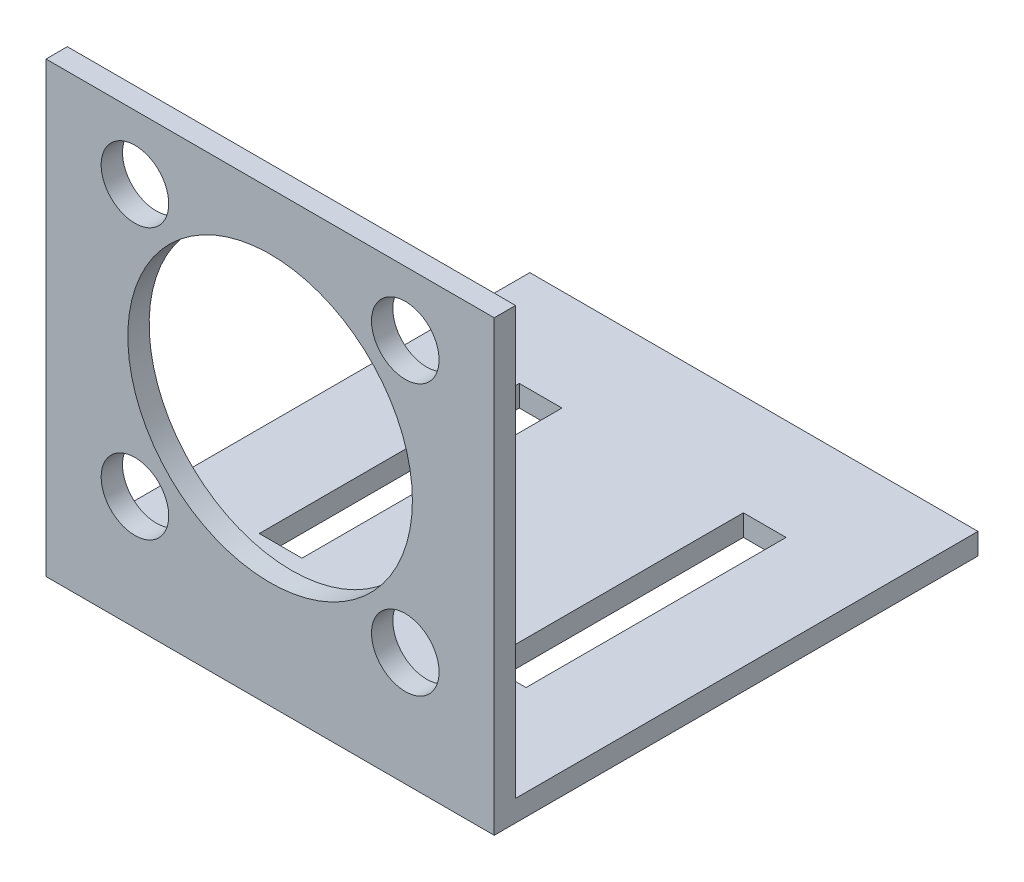
ISO-10303-21;
HEADER;
FILE_DESCRIPTION(('STEP AP214'),'2;1');
FILE_NAME('part.step','',(''),(''),'','','');
FILE_SCHEMA(('AUTOMOTIVE_DESIGN { 1 0 10303 214 1 1 1 1 }'));
ENDSEC;
DATA;
#1=APPLICATION_CONTEXT('core data for automotive mechanical design processes');
#2=APPLICATION_PROTOCOL_DEFINITION('international standard','automotive_design',2000,#1);
#3=PRODUCT_CONTEXT('',#1,'mechanical');
#4=PRODUCT('Part','Part','',(#3));
#5=PRODUCT_RELATED_PRODUCT_CATEGORY('part','',(#4));
#6=PRODUCT_DEFINITION_FORMATION('','',#4);
#7=PRODUCT_DEFINITION_CONTEXT('part definition',#1,'design');
#8=PRODUCT_DEFINITION('design','',#6,#7);
#9=PRODUCT_DEFINITION_SHAPE('','',#8);
#10=(LENGTH_UNIT() NAMED_UNIT(*) SI_UNIT(.MILLI.,.METRE.));
#11=(NAMED_UNIT(*) PLANE_ANGLE_UNIT() SI_UNIT($,.RADIAN.));
#12=(NAMED_UNIT(*) SI_UNIT($,.STERADIAN.) SOLID_ANGLE_UNIT());
#13=UNCERTAINTY_MEASURE_WITH_UNIT(LENGTH_MEASURE(1.E-05),#10,'distance_accuracy_value','');
#14=(GEOMETRIC_REPRESENTATION_CONTEXT(3) GLOBAL_UNCERTAINTY_ASSIGNED_CONTEXT((#13)) GLOBAL_UNIT_ASSIGNED_CONTEXT((#10,
#11,#12)) REPRESENTATION_CONTEXT('',''));
#15=CARTESIAN_POINT('',(0.,0.,0.));
#16=DIRECTION('',(0.,0.,1.));
#17=DIRECTION('',(1.,0.,0.));
#18=AXIS2_PLACEMENT_3D('',#15,#16,#17);
#19=CARTESIAN_POINT('',(63.,29.4238410596027,34.8026733297217));
#20=DIRECTION('',(0.,-1.,0.));
#21=DIRECTION('',(0.,0.,-1.));
#22=AXIS2_PLACEMENT_3D('',#19,#20,#21);
#23=PLANE('',#22);
#24=DIRECTION('',(0.,0.,1.));
#25=VECTOR('',#24,1.);
#26=CARTESIAN_POINT('',(0.,29.4238410596027,34.8026733297217));
#27=LINE('',#26,#25);
#28=CARTESIAN_POINT('',(0.,29.4238410596027,31.8026733297217));
#29=VERTEX_POINT('',#28);
#30=CARTESIAN_POINT('',(0.,29.4238410596027,34.8026733297217));
#31=VERTEX_POINT('',#30);
#32=EDGE_CURVE('E235',#29,#31,#27,.T.);
#33=ORIENTED_EDGE('',*,*,#32,.T.);
#34=DIRECTION('',(-1.,0.,0.));
#35=VECTOR('',#34,1.);
#36=CARTESIAN_POINT('',(63.,29.4238410596027,34.8026733297217));
#37=LINE('',#36,#35);
#38=CARTESIAN_POINT('',(63.,29.4238410596027,34.8026733297217));
#39=VERTEX_POINT('',#38);
#40=EDGE_CURVE('E11',#39,#31,#37,.T.);
#41=ORIENTED_EDGE('',*,*,#40,.F.);
#42=DIRECTION('',(0.,0.,1.));
#43=VECTOR('',#42,1.);
#44=CARTESIAN_POINT('',(63.,29.4238410596027,34.8026733297217));
#45=LINE('',#44,#43);
#46=CARTESIAN_POINT('',(63.,29.4238410596027,31.8026733297217));
#47=VERTEX_POINT('',#46);
#48=EDGE_CURVE('E220',#47,#39,#45,.T.);
#49=ORIENTED_EDGE('',*,*,#48,.F.);
#50=DIRECTION('',(-1.,0.,0.));
#51=VECTOR('',#50,1.);
#52=CARTESIAN_POINT('',(63.,29.4238410596027,31.8026733297217));
#53=LINE('',#52,#51);
#54=EDGE_CURVE('E234',#47,#29,#53,.T.);
#55=ORIENTED_EDGE('',*,*,#54,.T.);
#56=EDGE_LOOP('',(#33,#41,#49,#55));
#57=FACE_BOUND('',#56,.T.);
#58=ADVANCED_FACE('F32',(#57),#23,.F.);
#59=CARTESIAN_POINT('',(63.,-33.5761589403973,34.8026733297217));
#60=DIRECTION('',(0.,0.,-1.));
#61=DIRECTION('',(0.,1.,0.));
#62=AXIS2_PLACEMENT_3D('',#59,#60,#61);
#63=PLANE('',#62);
#64=CARTESIAN_POINT('',(50.5,20.4238410596027,34.8026733297217));
#65=DIRECTION('',(0.,0.,1.));
#66=DIRECTION('',(-1.,0.,0.));
#67=AXIS2_PLACEMENT_3D('',#64,#65,#66);
#68=CIRCLE('',#67,4.74999999999999);
#69=CARTESIAN_POINT('',(45.75,20.4238410596027,34.8026733297217));
#70=VERTEX_POINT('',#69);
#71=EDGE_CURVE('E211',#70,#70,#68,.T.);
#72=ORIENTED_EDGE('',*,*,#71,.F.);
#73=EDGE_LOOP('',(#72));
#74=FACE_BOUND('',#73,.T.);
#75=CARTESIAN_POINT('',(12.5,-17.5761589403973,34.8026733297217));
#76=DIRECTION('',(0.,0.,1.));
#77=DIRECTION('',(-1.,0.,0.));
#78=AXIS2_PLACEMENT_3D('',#75,#76,#77);
#79=CIRCLE('',#78,4.75);
#80=CARTESIAN_POINT('',(7.74999999999999,-17.5761589403973,34.8026733297217));
#81=VERTEX_POINT('',#80);
#82=EDGE_CURVE('E210',#81,#81,#79,.T.);
#83=ORIENTED_EDGE('',*,*,#82,.F.);
#84=EDGE_LOOP('',(#83));
#85=FACE_BOUND('',#84,.T.);
#86=CARTESIAN_POINT('',(31.5,1.42384105960268,34.8026733297217));
#87=DIRECTION('',(0.,0.,1.));
#88=DIRECTION('',(1.,0.,0.));
#89=AXIS2_PLACEMENT_3D('',#86,#87,#88);
#90=CIRCLE('',#89,20.);
#91=CARTESIAN_POINT('',(51.5,1.42384105960268,34.8026733297217));
#92=VERTEX_POINT('',#91);
#93=EDGE_CURVE('E172',#92,#92,#90,.T.);
#94=ORIENTED_EDGE('',*,*,#93,.F.);
#95=EDGE_LOOP('',(#94));
#96=FACE_BOUND('',#95,.T.);
#97=CARTESIAN_POINT('',(12.5,20.4238410596027,34.8026733297217));
#98=DIRECTION('',(0.,0.,1.));
#99=DIRECTION('',(1.,0.,0.));
#100=AXIS2_PLACEMENT_3D('',#97,#98,#99);
#101=CIRCLE('',#100,4.74999999999999);
#102=CARTESIAN_POINT('',(17.25,20.4238410596027,34.8026733297217));
#103=VERTEX_POINT('',#102);
#104=EDGE_CURVE('E207',#103,#103,#101,.T.);
#105=ORIENTED_EDGE('',*,*,#104,.F.);
#106=EDGE_LOOP('',(#105));
#107=FACE_BOUND('',#106,.T.);
#108=CARTESIAN_POINT('',(50.5,-17.5761589403973,34.8026733297217));
#109=DIRECTION('',(0.,0.,1.));
#110=DIRECTION('',(1.,0.,0.));
#111=AXIS2_PLACEMENT_3D('',#108,#109,#110);
#112=CIRCLE('',#111,4.75);
#113=CARTESIAN_POINT('',(55.25,-17.5761589403973,34.8026733297217));
#114=VERTEX_POINT('',#113);
#115=EDGE_CURVE('E214',#114,#114,#112,.T.);
#116=ORIENTED_EDGE('',*,*,#115,.F.);
#117=EDGE_LOOP('',(#116));
#118=FACE_BOUND('',#117,.T.);
#119=DIRECTION('',(0.,-1.,0.));
#120=VECTOR('',#119,1.);
#121=CARTESIAN_POINT('',(0.,-33.5761589403973,34.8026733297217));
#122=LINE('',#121,#120);
#123=CARTESIAN_POINT('',(0.,-33.5761589403973,34.8026733297217));
#124=VERTEX_POINT('',#123);
#125=EDGE_CURVE('E238',#31,#124,#122,.T.);
#126=ORIENTED_EDGE('',*,*,#125,.T.);
#127=DIRECTION('',(-1.,0.,0.));
#128=VECTOR('',#127,1.);
#129=CARTESIAN_POINT('',(63.,-33.5761589403973,34.8026733297217));
#130=LINE('',#129,#128);
#131=CARTESIAN_POINT('',(63.,-33.5761589403973,34.8026733297217));
#132=VERTEX_POINT('',#131);
#133=EDGE_CURVE('E40',#132,#124,#130,.T.);
#134=ORIENTED_EDGE('',*,*,#133,.F.);
#135=DIRECTION('',(0.,-1.,0.));
#136=VECTOR('',#135,1.);
#137=CARTESIAN_POINT('',(63.,-33.5761589403973,34.8026733297217));
#138=LINE('',#137,#136);
#139=EDGE_CURVE('E223',#39,#132,#138,.T.);
#140=ORIENTED_EDGE('',*,*,#139,.F.);
#141=ORIENTED_EDGE('',*,*,#40,.T.);
#142=EDGE_LOOP('',(#126,#134,#140,#141));
#143=FACE_BOUND('',#142,.T.);
#144=ADVANCED_FACE('F294',(#74,#85,#96,#107,#118,#143),#63,.F.);
#145=CARTESIAN_POINT('',(63.,-33.5761589403973,-33.1973266702783));
#146=DIRECTION('',(0.,1.,0.));
#147=DIRECTION('',(0.,0.,1.));
#148=AXIS2_PLACEMENT_3D('',#145,#146,#147);
#149=PLANE('',#148);
#150=DIRECTION('',(-1.,0.,0.));
#151=VECTOR('',#150,1.);
#152=CARTESIAN_POINT('',(12.75,-33.5761589403973,-18.9726347985289));
#153=LINE('',#152,#151);
#154=CARTESIAN_POINT('',(18.75,-33.5761589403973,-18.9726347985289));
#155=VERTEX_POINT('',#154);
#156=CARTESIAN_POINT('',(12.75,-33.5761589403973,-18.9726347985289));
#157=VERTEX_POINT('',#156);
#158=EDGE_CURVE('E146',#155,#157,#153,.T.);
#159=ORIENTED_EDGE('',*,*,#158,.T.);
#160=DIRECTION('',(0.,0.,1.));
#161=VECTOR('',#160,1.);
#162=CARTESIAN_POINT('',(12.75,-33.5761589403973,-18.9726347985289));
#163=LINE('',#162,#161);
#164=CARTESIAN_POINT('',(12.75,-33.5761589403973,17.5779814579723));
#165=VERTEX_POINT('',#164);
#166=EDGE_CURVE('E138',#157,#165,#163,.T.);
#167=ORIENTED_EDGE('',*,*,#166,.T.);
#168=DIRECTION('',(1.,0.,0.));
#169=VECTOR('',#168,1.);
#170=CARTESIAN_POINT('',(12.75,-33.5761589403973,17.5779814579723));
#171=LINE('',#170,#169);
#172=CARTESIAN_POINT('',(18.75,-33.5761589403973,17.5779814579723));
#173=VERTEX_POINT('',#172);
#174=EDGE_CURVE('E149',#165,#173,#171,.T.);
#175=ORIENTED_EDGE('',*,*,#174,.T.);
#176=DIRECTION('',(0.,0.,-1.));
#177=VECTOR('',#176,1.);
#178=CARTESIAN_POINT('',(18.75,-33.5761589403973,-18.9726347985289));
#179=LINE('',#178,#177);
#180=EDGE_CURVE('E48',#173,#155,#179,.T.);
#181=ORIENTED_EDGE('',*,*,#180,.T.);
#182=EDGE_LOOP('',(#159,#167,#175,#181));
#183=FACE_BOUND('',#182,.T.);
#184=DIRECTION('',(1.,0.,0.));
#185=VECTOR('',#184,1.);
#186=CARTESIAN_POINT('',(50.25,-33.5761589403973,17.5779814579723));
#187=LINE('',#186,#185);
#188=CARTESIAN_POINT('',(44.25,-33.5761589403973,17.5779814579723));
#189=VERTEX_POINT('',#188);
#190=CARTESIAN_POINT('',(50.25,-33.5761589403973,17.5779814579723));
#191=VERTEX_POINT('',#190);
#192=EDGE_CURVE('E184',#189,#191,#187,.T.);
#193=ORIENTED_EDGE('',*,*,#192,.T.);
#194=DIRECTION('',(0.,0.,-1.));
#195=VECTOR('',#194,1.);
#196=CARTESIAN_POINT('',(50.25,-33.5761589403973,-18.9726347985289));
#197=LINE('',#196,#195);
#198=CARTESIAN_POINT('',(50.25,-33.5761589403973,-18.9726347985289));
#199=VERTEX_POINT('',#198);
#200=EDGE_CURVE('E176',#191,#199,#197,.T.);
#201=ORIENTED_EDGE('',*,*,#200,.T.);
#202=DIRECTION('',(-1.,0.,0.));
#203=VECTOR('',#202,1.);
#204=CARTESIAN_POINT('',(50.25,-33.5761589403973,-18.9726347985289));
#205=LINE('',#204,#203);
#206=CARTESIAN_POINT('',(44.25,-33.5761589403973,-18.9726347985289));
#207=VERTEX_POINT('',#206);
#208=EDGE_CURVE('E179',#199,#207,#205,.T.);
#209=ORIENTED_EDGE('',*,*,#208,.T.);
#210=DIRECTION('',(0.,0.,1.));
#211=VECTOR('',#210,1.);
#212=CARTESIAN_POINT('',(44.25,-33.5761589403973,-18.9726347985289));
#213=LINE('',#212,#211);
#214=EDGE_CURVE('E56',#207,#189,#213,.T.);
#215=ORIENTED_EDGE('',*,*,#214,.T.);
#216=EDGE_LOOP('',(#193,#201,#209,#215));
#217=FACE_BOUND('',#216,.T.);
#218=DIRECTION('',(0.,0.,-1.));
#219=VECTOR('',#218,1.);
#220=CARTESIAN_POINT('',(0.,-33.5761589403973,-33.1973266702783));
#221=LINE('',#220,#219);
#222=CARTESIAN_POINT('',(0.,-33.5761589403973,-33.1973266702783));
#223=VERTEX_POINT('',#222);
#224=EDGE_CURVE('E240',#124,#223,#221,.T.);
#225=ORIENTED_EDGE('',*,*,#224,.T.);
#226=DIRECTION('',(-1.,0.,0.));
#227=VECTOR('',#226,1.);
#228=CARTESIAN_POINT('',(63.,-33.5761589403973,-33.1973266702783));
#229=LINE('',#228,#227);
#230=CARTESIAN_POINT('',(63.,-33.5761589403973,-33.1973266702783));
#231=VERTEX_POINT('',#230);
#232=EDGE_CURVE('E255',#231,#223,#229,.T.);
#233=ORIENTED_EDGE('',*,*,#232,.F.);
#234=DIRECTION('',(0.,0.,-1.));
#235=VECTOR('',#234,1.);
#236=CARTESIAN_POINT('',(63.,-33.5761589403973,-33.1973266702783));
#237=LINE('',#236,#235);
#238=EDGE_CURVE('E226',#132,#231,#237,.T.);
#239=ORIENTED_EDGE('',*,*,#238,.F.);
#240=ORIENTED_EDGE('',*,*,#133,.T.);
#241=EDGE_LOOP('',(#225,#233,#239,#240));
#242=FACE_BOUND('',#241,.T.);
#243=ADVANCED_FACE('F153',(#183,#217,#242),#149,.F.);
#244=CARTESIAN_POINT('',(63.,-30.5761589403973,-33.1973266702783));
#245=DIRECTION('',(0.,0.,1.));
#246=DIRECTION('',(0.,-1.,0.));
#247=AXIS2_PLACEMENT_3D('',#244,#245,#246);
#248=PLANE('',#247);
#249=DIRECTION('',(0.,1.,0.));
#250=VECTOR('',#249,1.);
#251=CARTESIAN_POINT('',(0.,-30.5761589403973,-33.1973266702783));
#252=LINE('',#251,#250);
#253=CARTESIAN_POINT('',(0.,-30.5761589403973,-33.1973266702783));
#254=VERTEX_POINT('',#253);
#255=EDGE_CURVE('E242',#223,#254,#252,.T.);
#256=ORIENTED_EDGE('',*,*,#255,.T.);
#257=DIRECTION('',(-1.,0.,0.));
#258=VECTOR('',#257,1.);
#259=CARTESIAN_POINT('',(63.,-30.5761589403973,-33.1973266702783));
#260=LINE('',#259,#258);
#261=CARTESIAN_POINT('',(63.,-30.5761589403973,-33.1973266702783));
#262=VERTEX_POINT('',#261);
#263=EDGE_CURVE('E252',#262,#254,#260,.T.);
#264=ORIENTED_EDGE('',*,*,#263,.F.);
#265=DIRECTION('',(0.,1.,0.));
#266=VECTOR('',#265,1.);
#267=CARTESIAN_POINT('',(63.,-30.5761589403973,-33.1973266702783));
#268=LINE('',#267,#266);
#269=EDGE_CURVE('E228',#231,#262,#268,.T.);
#270=ORIENTED_EDGE('',*,*,#269,.F.);
#271=ORIENTED_EDGE('',*,*,#232,.T.);
#272=EDGE_LOOP('',(#256,#264,#270,#271));
#273=FACE_BOUND('',#272,.T.);
#274=ADVANCED_FACE('F323',(#273),#248,.F.);
#275=CARTESIAN_POINT('',(63.,-30.5761589403973,31.8026733297217));
#276=DIRECTION('',(0.,-1.,0.));
#277=DIRECTION('',(0.,0.,-1.));
#278=AXIS2_PLACEMENT_3D('',#275,#276,#277);
#279=PLANE('',#278);
#280=DIRECTION('',(1.,0.,0.));
#281=VECTOR('',#280,1.);
#282=CARTESIAN_POINT('',(12.75,-30.5761589403973,17.5779814579723));
#283=LINE('',#282,#281);
#284=CARTESIAN_POINT('',(12.75,-30.5761589403973,17.5779814579723));
#285=VERTEX_POINT('',#284);
#286=CARTESIAN_POINT('',(18.75,-30.5761589403973,17.5779814579723));
#287=VERTEX_POINT('',#286);
#288=EDGE_CURVE('E165',#285,#287,#283,.T.);
#289=ORIENTED_EDGE('',*,*,#288,.F.);
#290=DIRECTION('',(0.,0.,1.));
#291=VECTOR('',#290,1.);
#292=CARTESIAN_POINT('',(12.75,-30.5761589403973,-18.9726347985289));
#293=LINE('',#292,#291);
#294=CARTESIAN_POINT('',(12.75,-30.5761589403973,-18.9726347985289));
#295=VERTEX_POINT('',#294);
#296=EDGE_CURVE('E141',#295,#285,#293,.T.);
#297=ORIENTED_EDGE('',*,*,#296,.F.);
#298=DIRECTION('',(-1.,0.,0.));
#299=VECTOR('',#298,1.);
#300=CARTESIAN_POINT('',(12.75,-30.5761589403973,-18.9726347985289));
#301=LINE('',#300,#299);
#302=CARTESIAN_POINT('',(18.75,-30.5761589403973,-18.9726347985289));
#303=VERTEX_POINT('',#302);
#304=EDGE_CURVE('E156',#303,#295,#301,.T.);
#305=ORIENTED_EDGE('',*,*,#304,.F.);
#306=DIRECTION('',(0.,0.,-1.));
#307=VECTOR('',#306,1.);
#308=CARTESIAN_POINT('',(18.75,-30.5761589403973,-18.9726347985289));
#309=LINE('',#308,#307);
#310=EDGE_CURVE('E159',#287,#303,#309,.T.);
#311=ORIENTED_EDGE('',*,*,#310,.F.);
#312=EDGE_LOOP('',(#289,#297,#305,#311));
#313=FACE_BOUND('',#312,.T.);
#314=DIRECTION('',(-1.,0.,0.));
#315=VECTOR('',#314,1.);
#316=CARTESIAN_POINT('',(50.25,-30.5761589403973,-18.9726347985289));
#317=LINE('',#316,#315);
#318=CARTESIAN_POINT('',(50.25,-30.5761589403973,-18.9726347985289));
#319=VERTEX_POINT('',#318);
#320=CARTESIAN_POINT('',(44.25,-30.5761589403973,-18.9726347985289));
#321=VERTEX_POINT('',#320);
#322=EDGE_CURVE('E190',#319,#321,#317,.T.);
#323=ORIENTED_EDGE('',*,*,#322,.F.);
#324=DIRECTION('',(0.,0.,-1.));
#325=VECTOR('',#324,1.);
#326=CARTESIAN_POINT('',(50.25,-30.5761589403973,-18.9726347985289));
#327=LINE('',#326,#325);
#328=CARTESIAN_POINT('',(50.25,-30.5761589403973,17.5779814579723));
#329=VERTEX_POINT('',#328);
#330=EDGE_CURVE('E188',#329,#319,#327,.T.);
#331=ORIENTED_EDGE('',*,*,#330,.F.);
#332=DIRECTION('',(1.,0.,0.));
#333=VECTOR('',#332,1.);
#334=CARTESIAN_POINT('',(50.25,-30.5761589403973,17.5779814579723));
#335=LINE('',#334,#333);
#336=CARTESIAN_POINT('',(44.25,-30.5761589403973,17.5779814579723));
#337=VERTEX_POINT('',#336);
#338=EDGE_CURVE('E180',#337,#329,#335,.T.);
#339=ORIENTED_EDGE('',*,*,#338,.F.);
#340=DIRECTION('',(0.,0.,1.));
#341=VECTOR('',#340,1.);
#342=CARTESIAN_POINT('',(44.25,-30.5761589403973,-18.9726347985289));
#343=LINE('',#342,#341);
#344=EDGE_CURVE('E193',#321,#337,#343,.T.);
#345=ORIENTED_EDGE('',*,*,#344,.F.);
#346=EDGE_LOOP('',(#323,#331,#339,#345));
#347=FACE_BOUND('',#346,.T.);
#348=DIRECTION('',(0.,0.,1.));
#349=VECTOR('',#348,1.);
#350=CARTESIAN_POINT('',(0.,-30.5761589403973,31.8026733297217));
#351=LINE('',#350,#349);
#352=CARTESIAN_POINT('',(0.,-30.5761589403973,31.8026733297217));
#353=VERTEX_POINT('',#352);
#354=EDGE_CURVE('E244',#254,#353,#351,.T.);
#355=ORIENTED_EDGE('',*,*,#354,.T.);
#356=DIRECTION('',(-1.,0.,0.));
#357=VECTOR('',#356,1.);
#358=CARTESIAN_POINT('',(63.,-30.5761589403973,31.8026733297217));
#359=LINE('',#358,#357);
#360=CARTESIAN_POINT('',(63.,-30.5761589403973,31.8026733297217));
#361=VERTEX_POINT('',#360);
#362=EDGE_CURVE('E249',#361,#353,#359,.T.);
#363=ORIENTED_EDGE('',*,*,#362,.F.);
#364=DIRECTION('',(0.,0.,1.));
#365=VECTOR('',#364,1.);
#366=CARTESIAN_POINT('',(63.,-30.5761589403973,31.8026733297217));
#367=LINE('',#366,#365);
#368=EDGE_CURVE('E230',#262,#361,#367,.T.);
#369=ORIENTED_EDGE('',*,*,#368,.F.);
#370=ORIENTED_EDGE('',*,*,#263,.T.);
#371=EDGE_LOOP('',(#355,#363,#369,#370));
#372=FACE_BOUND('',#371,.T.);
#373=ADVANCED_FACE('F320',(#313,#347,#372),#279,.F.);
#374=CARTESIAN_POINT('',(63.,29.4238410596027,31.8026733297217));
#375=DIRECTION('',(0.,0.,1.));
#376=DIRECTION('',(0.,-1.,0.));
#377=AXIS2_PLACEMENT_3D('',#374,#375,#376);
#378=PLANE('',#377);
#379=CARTESIAN_POINT('',(50.5,20.4238410596027,31.8026733297217));
#380=DIRECTION('',(0.,0.,1.));
#381=DIRECTION('',(0.,-1.,0.));
#382=AXIS2_PLACEMENT_3D('',#379,#380,#381);
#383=CIRCLE('',#382,4.74999999999999);
#384=CARTESIAN_POINT('',(50.5,15.6738410596027,31.8026733297217));
#385=VERTEX_POINT('',#384);
#386=EDGE_CURVE('E35',#385,#385,#383,.T.);
#387=ORIENTED_EDGE('',*,*,#386,.T.);
#388=EDGE_LOOP('',(#387));
#389=FACE_BOUND('',#388,.T.);
#390=CARTESIAN_POINT('',(12.5,-17.5761589403973,31.8026733297217));
#391=DIRECTION('',(0.,0.,1.));
#392=DIRECTION('',(0.,-1.,0.));
#393=AXIS2_PLACEMENT_3D('',#390,#391,#392);
#394=CIRCLE('',#393,4.75);
#395=CARTESIAN_POINT('',(12.5,-22.3261589403973,31.8026733297217));
#396=VERTEX_POINT('',#395);
#397=EDGE_CURVE('E267',#396,#396,#394,.T.);
#398=ORIENTED_EDGE('',*,*,#397,.T.);
#399=EDGE_LOOP('',(#398));
#400=FACE_BOUND('',#399,.T.);
#401=CARTESIAN_POINT('',(31.5,1.42384105960268,31.8026733297217));
#402=DIRECTION('',(0.,0.,1.));
#403=DIRECTION('',(0.,-1.,0.));
#404=AXIS2_PLACEMENT_3D('',#401,#402,#403);
#405=CIRCLE('',#404,20.);
#406=CARTESIAN_POINT('',(31.5,-18.5761589403973,31.8026733297217));
#407=VERTEX_POINT('',#406);
#408=EDGE_CURVE('E265',#407,#407,#405,.T.);
#409=ORIENTED_EDGE('',*,*,#408,.T.);
#410=EDGE_LOOP('',(#409));
#411=FACE_BOUND('',#410,.T.);
#412=CARTESIAN_POINT('',(12.5,20.4238410596027,31.8026733297217));
#413=DIRECTION('',(0.,0.,1.));
#414=DIRECTION('',(0.,-1.,0.));
#415=AXIS2_PLACEMENT_3D('',#412,#413,#414);
#416=CIRCLE('',#415,4.74999999999999);
#417=CARTESIAN_POINT('',(12.5,15.6738410596027,31.8026733297217));
#418=VERTEX_POINT('',#417);
#419=EDGE_CURVE('E262',#418,#418,#416,.T.);
#420=ORIENTED_EDGE('',*,*,#419,.T.);
#421=EDGE_LOOP('',(#420));
#422=FACE_BOUND('',#421,.T.);
#423=CARTESIAN_POINT('',(50.5,-17.5761589403973,31.8026733297217));
#424=DIRECTION('',(0.,0.,1.));
#425=DIRECTION('',(0.,-1.,0.));
#426=AXIS2_PLACEMENT_3D('',#423,#424,#425);
#427=CIRCLE('',#426,4.75);
#428=CARTESIAN_POINT('',(50.5,-22.3261589403973,31.8026733297217));
#429=VERTEX_POINT('',#428);
#430=EDGE_CURVE('E219',#429,#429,#427,.T.);
#431=ORIENTED_EDGE('',*,*,#430,.T.);
#432=EDGE_LOOP('',(#431));
#433=FACE_BOUND('',#432,.T.);
#434=DIRECTION('',(0.,1.,0.));
#435=VECTOR('',#434,1.);
#436=CARTESIAN_POINT('',(0.,29.4238410596027,31.8026733297217));
#437=LINE('',#436,#435);
#438=EDGE_CURVE('E224',#353,#29,#437,.T.);
#439=ORIENTED_EDGE('',*,*,#438,.T.);
#440=ORIENTED_EDGE('',*,*,#54,.F.);
#441=DIRECTION('',(0.,1.,0.));
#442=VECTOR('',#441,1.);
#443=CARTESIAN_POINT('',(63.,29.4238410596027,31.8026733297217));
#444=LINE('',#443,#442);
#445=EDGE_CURVE('E232',#361,#47,#444,.T.);
#446=ORIENTED_EDGE('',*,*,#445,.F.);
#447=ORIENTED_EDGE('',*,*,#362,.T.);
#448=EDGE_LOOP('',(#439,#440,#446,#447));
#449=FACE_BOUND('',#448,.T.);
#450=ADVANCED_FACE('F274',(#389,#400,#411,#422,#433,#449),#378,.F.);
#451=CARTESIAN_POINT('',(63.,0.,0.));
#452=DIRECTION('',(-1.,0.,0.));
#453=DIRECTION('',(0.,0.,1.));
#454=AXIS2_PLACEMENT_3D('',#451,#452,#453);
#455=PLANE('',#454);
#456=ORIENTED_EDGE('',*,*,#48,.T.);
#457=ORIENTED_EDGE('',*,*,#139,.T.);
#458=ORIENTED_EDGE('',*,*,#238,.T.);
#459=ORIENTED_EDGE('',*,*,#269,.T.);
#460=ORIENTED_EDGE('',*,*,#368,.T.);
#461=ORIENTED_EDGE('',*,*,#445,.T.);
#462=EDGE_LOOP('',(#456,#457,#458,#459,#460,#461));
#463=FACE_BOUND('',#462,.T.);
#464=ADVANCED_FACE('F314',(#463),#455,.F.);
#465=CARTESIAN_POINT('',(0.,0.,0.));
#466=DIRECTION('',(-1.,0.,0.));
#467=DIRECTION('',(0.,0.,1.));
#468=AXIS2_PLACEMENT_3D('',#465,#466,#467);
#469=PLANE('',#468);
#470=ORIENTED_EDGE('',*,*,#32,.F.);
#471=ORIENTED_EDGE('',*,*,#438,.F.);
#472=ORIENTED_EDGE('',*,*,#354,.F.);
#473=ORIENTED_EDGE('',*,*,#255,.F.);
#474=ORIENTED_EDGE('',*,*,#224,.F.);
#475=ORIENTED_EDGE('',*,*,#125,.F.);
#476=EDGE_LOOP('',(#470,#471,#472,#473,#474,#475));
#477=FACE_BOUND('',#476,.T.);
#478=ADVANCED_FACE('F306',(#477),#469,.T.);
#479=CARTESIAN_POINT('',(50.5,-17.5761589403973,-33.1973266702783));
#480=DIRECTION('',(0.,0.,1.));
#481=DIRECTION('',(1.,0.,0.));
#482=AXIS2_PLACEMENT_3D('',#479,#480,#481);
#483=CYLINDRICAL_SURFACE('',#482,4.75);
#484=ORIENTED_EDGE('',*,*,#115,.T.);
#485=EDGE_LOOP('',(#484));
#486=FACE_BOUND('',#485,.T.);
#487=ORIENTED_EDGE('',*,*,#430,.F.);
#488=EDGE_LOOP('',(#487));
#489=FACE_BOUND('',#488,.T.);
#490=ADVANCED_FACE('F341',(#486,#489),#483,.F.);
#491=CARTESIAN_POINT('',(12.5,20.4238410596027,-33.1973266702783));
#492=DIRECTION('',(0.,0.,1.));
#493=DIRECTION('',(1.,0.,0.));
#494=AXIS2_PLACEMENT_3D('',#491,#492,#493);
#495=CYLINDRICAL_SURFACE('',#494,4.74999999999999);
#496=ORIENTED_EDGE('',*,*,#104,.T.);
#497=EDGE_LOOP('',(#496));
#498=FACE_BOUND('',#497,.T.);
#499=ORIENTED_EDGE('',*,*,#419,.F.);
#500=EDGE_LOOP('',(#499));
#501=FACE_BOUND('',#500,.T.);
#502=ADVANCED_FACE('F345',(#498,#501),#495,.F.);
#503=CARTESIAN_POINT('',(31.5,1.42384105960268,-33.1973266702783));
#504=DIRECTION('',(0.,0.,1.));
#505=DIRECTION('',(1.,0.,0.));
#506=AXIS2_PLACEMENT_3D('',#503,#504,#505);
#507=CYLINDRICAL_SURFACE('',#506,20.);
#508=ORIENTED_EDGE('',*,*,#93,.T.);
#509=EDGE_LOOP('',(#508));
#510=FACE_BOUND('',#509,.T.);
#511=ORIENTED_EDGE('',*,*,#408,.F.);
#512=EDGE_LOOP('',(#511));
#513=FACE_BOUND('',#512,.T.);
#514=ADVANCED_FACE('F289',(#510,#513),#507,.F.);
#515=CARTESIAN_POINT('',(12.5,-17.5761589403973,-33.1973266702783));
#516=DIRECTION('',(0.,0.,1.));
#517=DIRECTION('',(1.,0.,0.));
#518=AXIS2_PLACEMENT_3D('',#515,#516,#517);
#519=CYLINDRICAL_SURFACE('',#518,4.75);
#520=ORIENTED_EDGE('',*,*,#82,.T.);
#521=EDGE_LOOP('',(#520));
#522=FACE_BOUND('',#521,.T.);
#523=ORIENTED_EDGE('',*,*,#397,.F.);
#524=EDGE_LOOP('',(#523));
#525=FACE_BOUND('',#524,.T.);
#526=ADVANCED_FACE('F279',(#522,#525),#519,.F.);
#527=CARTESIAN_POINT('',(50.5,20.4238410596027,-33.1973266702783));
#528=DIRECTION('',(0.,0.,1.));
#529=DIRECTION('',(1.,0.,0.));
#530=AXIS2_PLACEMENT_3D('',#527,#528,#529);
#531=CYLINDRICAL_SURFACE('',#530,4.74999999999999);
#532=ORIENTED_EDGE('',*,*,#71,.T.);
#533=EDGE_LOOP('',(#532));
#534=FACE_BOUND('',#533,.T.);
#535=ORIENTED_EDGE('',*,*,#386,.F.);
#536=EDGE_LOOP('',(#535));
#537=FACE_BOUND('',#536,.T.);
#538=ADVANCED_FACE('F276',(#534,#537),#531,.F.);
#539=CARTESIAN_POINT('',(50.25,-33.5761589403973,-18.9726347985289));
#540=DIRECTION('',(1.,0.,0.));
#541=DIRECTION('',(0.,0.,-1.));
#542=AXIS2_PLACEMENT_3D('',#539,#540,#541);
#543=PLANE('',#542);
#544=ORIENTED_EDGE('',*,*,#330,.T.);
#545=DIRECTION('',(0.,1.,0.));
#546=VECTOR('',#545,1.);
#547=CARTESIAN_POINT('',(50.25,-33.5761589403973,-18.9726347985289));
#548=LINE('',#547,#546);
#549=EDGE_CURVE('E187',#199,#319,#548,.T.);
#550=ORIENTED_EDGE('',*,*,#549,.F.);
#551=ORIENTED_EDGE('',*,*,#200,.F.);
#552=DIRECTION('',(0.,1.,0.));
#553=VECTOR('',#552,1.);
#554=CARTESIAN_POINT('',(50.25,-33.5761589403973,17.5779814579723));
#555=LINE('',#554,#553);
#556=EDGE_CURVE('E166',#191,#329,#555,.T.);
#557=ORIENTED_EDGE('',*,*,#556,.T.);
#558=EDGE_LOOP('',(#544,#550,#551,#557));
#559=FACE_BOUND('',#558,.T.);
#560=ADVANCED_FACE('F278',(#559),#543,.F.);
#561=CARTESIAN_POINT('',(50.25,-33.5761589403973,17.5779814579723));
#562=DIRECTION('',(0.,0.,1.));
#563=DIRECTION('',(1.,0.,0.));
#564=AXIS2_PLACEMENT_3D('',#561,#562,#563);
#565=PLANE('',#564);
#566=ORIENTED_EDGE('',*,*,#338,.T.);
#567=ORIENTED_EDGE('',*,*,#556,.F.);
#568=ORIENTED_EDGE('',*,*,#192,.F.);
#569=DIRECTION('',(0.,1.,0.));
#570=VECTOR('',#569,1.);
#571=CARTESIAN_POINT('',(44.25,-33.5761589403973,17.5779814579723));
#572=LINE('',#571,#570);
#573=EDGE_CURVE('E199',#189,#337,#572,.T.);
#574=ORIENTED_EDGE('',*,*,#573,.T.);
#575=EDGE_LOOP('',(#566,#567,#568,#574));
#576=FACE_BOUND('',#575,.T.);
#577=ADVANCED_FACE('F286',(#576),#565,.F.);
#578=CARTESIAN_POINT('',(44.25,-33.5761589403973,-18.9726347985289));
#579=DIRECTION('',(-1.,0.,0.));
#580=DIRECTION('',(0.,0.,1.));
#581=AXIS2_PLACEMENT_3D('',#578,#579,#580);
#582=PLANE('',#581);
#583=ORIENTED_EDGE('',*,*,#344,.T.);
#584=ORIENTED_EDGE('',*,*,#573,.F.);
#585=ORIENTED_EDGE('',*,*,#214,.F.);
#586=DIRECTION('',(0.,1.,0.));
#587=VECTOR('',#586,1.);
#588=CARTESIAN_POINT('',(44.25,-33.5761589403973,-18.9726347985289));
#589=LINE('',#588,#587);
#590=EDGE_CURVE('E201',#207,#321,#589,.T.);
#591=ORIENTED_EDGE('',*,*,#590,.T.);
#592=EDGE_LOOP('',(#583,#584,#585,#591));
#593=FACE_BOUND('',#592,.T.);
#594=ADVANCED_FACE('F366',(#593),#582,.F.);
#595=CARTESIAN_POINT('',(50.25,-33.5761589403973,-18.9726347985289));
#596=DIRECTION('',(0.,0.,-1.));
#597=DIRECTION('',(-1.,0.,0.));
#598=AXIS2_PLACEMENT_3D('',#595,#596,#597);
#599=PLANE('',#598);
#600=ORIENTED_EDGE('',*,*,#322,.T.);
#601=ORIENTED_EDGE('',*,*,#590,.F.);
#602=ORIENTED_EDGE('',*,*,#208,.F.);
#603=ORIENTED_EDGE('',*,*,#549,.T.);
#604=EDGE_LOOP('',(#600,#601,#602,#603));
#605=FACE_BOUND('',#604,.T.);
#606=ADVANCED_FACE('F363',(#605),#599,.F.);
#607=CARTESIAN_POINT('',(12.75,-33.5761589403973,-18.9726347985289));
#608=DIRECTION('',(-1.,0.,0.));
#609=DIRECTION('',(0.,0.,1.));
#610=AXIS2_PLACEMENT_3D('',#607,#608,#609);
#611=PLANE('',#610);
#612=ORIENTED_EDGE('',*,*,#296,.T.);
#613=DIRECTION('',(0.,1.,0.));
#614=VECTOR('',#613,1.);
#615=CARTESIAN_POINT('',(12.75,-33.5761589403973,17.5779814579723));
#616=LINE('',#615,#614);
#617=EDGE_CURVE('E134',#165,#285,#616,.T.);
#618=ORIENTED_EDGE('',*,*,#617,.F.);
#619=ORIENTED_EDGE('',*,*,#166,.F.);
#620=DIRECTION('',(0.,1.,0.));
#621=VECTOR('',#620,1.);
#622=CARTESIAN_POINT('',(12.75,-33.5761589403973,-18.9726347985289));
#623=LINE('',#622,#621);
#624=EDGE_CURVE('E170',#157,#295,#623,.T.);
#625=ORIENTED_EDGE('',*,*,#624,.T.);
#626=EDGE_LOOP('',(#612,#618,#619,#625));
#627=FACE_BOUND('',#626,.T.);
#628=ADVANCED_FACE('F136',(#627),#611,.F.);
#629=CARTESIAN_POINT('',(12.75,-33.5761589403973,-18.9726347985289));
#630=DIRECTION('',(0.,0.,-1.));
#631=DIRECTION('',(-1.,0.,0.));
#632=AXIS2_PLACEMENT_3D('',#629,#630,#631);
#633=PLANE('',#632);
#634=ORIENTED_EDGE('',*,*,#304,.T.);
#635=ORIENTED_EDGE('',*,*,#624,.F.);
#636=ORIENTED_EDGE('',*,*,#158,.F.);
#637=DIRECTION('',(0.,1.,0.));
#638=VECTOR('',#637,1.);
#639=CARTESIAN_POINT('',(18.75,-33.5761589403973,-18.9726347985289));
#640=LINE('',#639,#638);
#641=EDGE_CURVE('E173',#155,#303,#640,.T.);
#642=ORIENTED_EDGE('',*,*,#641,.T.);
#643=EDGE_LOOP('',(#634,#635,#636,#642));
#644=FACE_BOUND('',#643,.T.);
#645=ADVANCED_FACE('F375',(#644),#633,.F.);
#646=CARTESIAN_POINT('',(18.75,-33.5761589403973,-18.9726347985289));
#647=DIRECTION('',(1.,0.,0.));
#648=DIRECTION('',(0.,0.,-1.));
#649=AXIS2_PLACEMENT_3D('',#646,#647,#648);
#650=PLANE('',#649);
#651=ORIENTED_EDGE('',*,*,#310,.T.);
#652=ORIENTED_EDGE('',*,*,#641,.F.);
#653=ORIENTED_EDGE('',*,*,#180,.F.);
#654=DIRECTION('',(0.,1.,0.));
#655=VECTOR('',#654,1.);
#656=CARTESIAN_POINT('',(18.75,-33.5761589403973,17.5779814579723));
#657=LINE('',#656,#655);
#658=EDGE_CURVE('E145',#173,#287,#657,.T.);
#659=ORIENTED_EDGE('',*,*,#658,.T.);
#660=EDGE_LOOP('',(#651,#652,#653,#659));
#661=FACE_BOUND('',#660,.T.);
#662=ADVANCED_FACE('F378',(#661),#650,.F.);
#663=CARTESIAN_POINT('',(12.75,-33.5761589403973,17.5779814579723));
#664=DIRECTION('',(0.,0.,1.));
#665=DIRECTION('',(1.,0.,0.));
#666=AXIS2_PLACEMENT_3D('',#663,#664,#665);
#667=PLANE('',#666);
#668=ORIENTED_EDGE('',*,*,#288,.T.);
#669=ORIENTED_EDGE('',*,*,#658,.F.);
#670=ORIENTED_EDGE('',*,*,#174,.F.);
#671=ORIENTED_EDGE('',*,*,#617,.T.);
#672=EDGE_LOOP('',(#668,#669,#670,#671));
#673=FACE_BOUND('',#672,.T.);
#674=ADVANCED_FACE('F150',(#673),#667,.F.);
#675=CLOSED_SHELL('',(#58,#144,#243,#274,#373,#450,#464,#478,#490,#502,#514,#526,#538,#560,#577,
#594,#606,#628,#645,#662,#674));
#676=MANIFOLD_SOLID_BREP('B2',#675);
#677=ADVANCED_BREP_SHAPE_REPRESENTATION('',(#18,#676),#14);
#678=SHAPE_DEFINITION_REPRESENTATION(#9,#677);
ENDSEC;
END-ISO-10303-21;
